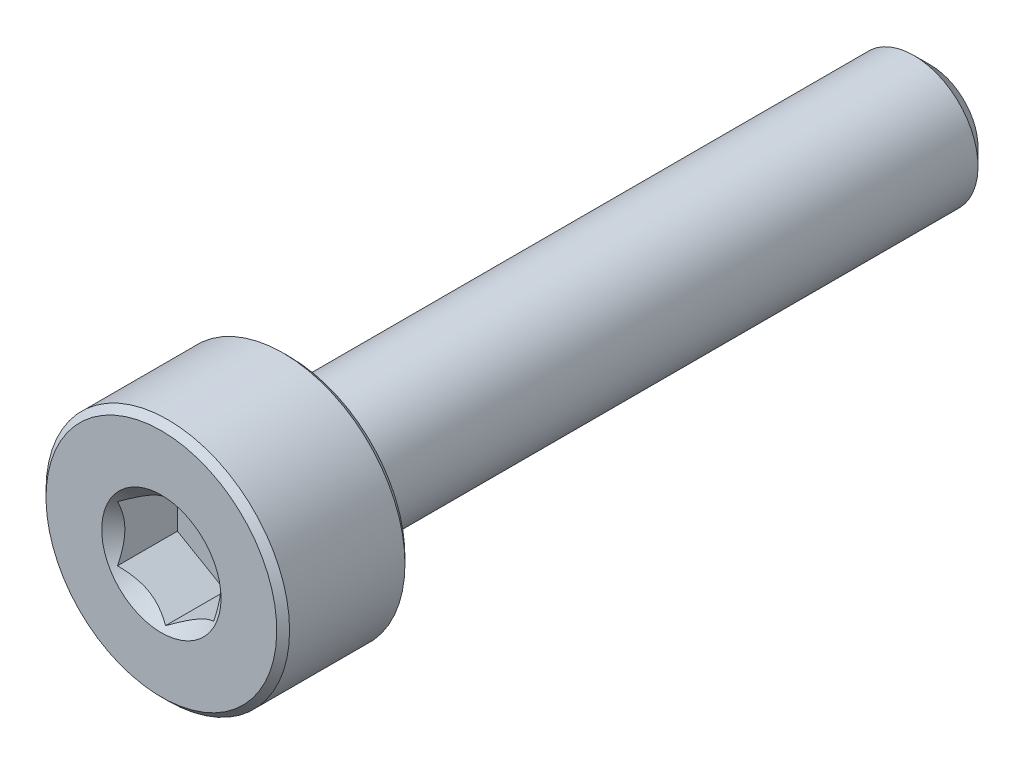
ISO-10303-21;
HEADER;
FILE_DESCRIPTION(('STEP AP214'),'2;1');
FILE_NAME('part.step','',(''),(''),'','','');
FILE_SCHEMA(('AUTOMOTIVE_DESIGN { 1 0 10303 214 1 1 1 1 }'));
ENDSEC;
DATA;
#1=APPLICATION_CONTEXT('core data for automotive mechanical design processes');
#2=APPLICATION_PROTOCOL_DEFINITION('international standard','automotive_design',2000,#1);
#3=PRODUCT_CONTEXT('',#1,'mechanical');
#4=PRODUCT('Part','Part','',(#3));
#5=PRODUCT_RELATED_PRODUCT_CATEGORY('part','',(#4));
#6=PRODUCT_DEFINITION_FORMATION('','',#4);
#7=PRODUCT_DEFINITION_CONTEXT('part definition',#1,'design');
#8=PRODUCT_DEFINITION('design','',#6,#7);
#9=PRODUCT_DEFINITION_SHAPE('','',#8);
#10=(LENGTH_UNIT() NAMED_UNIT(*) SI_UNIT(.MILLI.,.METRE.));
#11=(NAMED_UNIT(*) PLANE_ANGLE_UNIT() SI_UNIT($,.RADIAN.));
#12=(NAMED_UNIT(*) SI_UNIT($,.STERADIAN.) SOLID_ANGLE_UNIT());
#13=UNCERTAINTY_MEASURE_WITH_UNIT(LENGTH_MEASURE(1.E-05),#10,'distance_accuracy_value','');
#14=(GEOMETRIC_REPRESENTATION_CONTEXT(3) GLOBAL_UNCERTAINTY_ASSIGNED_CONTEXT((#13)) GLOBAL_UNIT_ASSIGNED_CONTEXT((#10,
#11,#12)) REPRESENTATION_CONTEXT('',''));
#15=CARTESIAN_POINT('',(0.,0.,0.));
#16=DIRECTION('',(0.,0.,1.));
#17=DIRECTION('',(1.,0.,0.));
#18=AXIS2_PLACEMENT_3D('',#15,#16,#17);
#19=CARTESIAN_POINT('',(0.,0.740192378864668,-6.));
#20=DIRECTION('',(0.,0.,-1.));
#21=DIRECTION('',(0.,1.,0.));
#22=AXIS2_PLACEMENT_3D('',#19,#20,#21);
#23=PLANE('',#22);
#24=CARTESIAN_POINT('',(0.,0.,-6.));
#25=DIRECTION('',(0.,0.,-1.));
#26=DIRECTION('',(0.,1.,0.));
#27=AXIS2_PLACEMENT_3D('',#24,#25,#26);
#28=CIRCLE('',#27,0.740192378864668);
#29=CARTESIAN_POINT('',(0.,0.740192378864668,-6.));
#30=VERTEX_POINT('',#29);
#31=EDGE_CURVE('E57',#30,#30,#28,.T.);
#32=ORIENTED_EDGE('',*,*,#31,.T.);
#33=EDGE_LOOP('',(#32));
#34=FACE_BOUND('',#33,.T.);
#35=ADVANCED_FACE('F43',(#34),#23,.T.);
#36=CARTESIAN_POINT('',(0.,0.,-6.));
#37=DIRECTION('',(0.,0.,1.));
#38=DIRECTION('',(0.,-1.,0.));
#39=AXIS2_PLACEMENT_3D('',#36,#37,#38);
#40=CONICAL_SURFACE('',#39,0.740192378864668,0.785398163397447);
#41=CARTESIAN_POINT('',(0.,0.,-5.74019237886467));
#42=DIRECTION('',(0.,0.,-1.));
#43=DIRECTION('',(0.,1.,0.));
#44=AXIS2_PLACEMENT_3D('',#41,#42,#43);
#45=CIRCLE('',#44,1.);
#46=CARTESIAN_POINT('',(0.,1.,-5.74019237886467));
#47=VERTEX_POINT('',#46);
#48=EDGE_CURVE('E175',#47,#47,#45,.T.);
#49=ORIENTED_EDGE('',*,*,#48,.T.);
#50=EDGE_LOOP('',(#49));
#51=FACE_BOUND('',#50,.T.);
#52=ORIENTED_EDGE('',*,*,#31,.F.);
#53=EDGE_LOOP('',(#52));
#54=FACE_BOUND('',#53,.T.);
#55=ADVANCED_FACE('F183',(#51,#54),#40,.T.);
#56=CARTESIAN_POINT('',(0.,0.,-6.));
#57=DIRECTION('',(0.,0.,-1.));
#58=DIRECTION('',(0.,1.,0.));
#59=AXIS2_PLACEMENT_3D('',#56,#57,#58);
#60=CYLINDRICAL_SURFACE('',#59,1.);
#61=CARTESIAN_POINT('',(0.,0.,3.9));
#62=DIRECTION('',(0.,0.,-1.));
#63=DIRECTION('',(0.,1.,0.));
#64=AXIS2_PLACEMENT_3D('',#61,#62,#63);
#65=CIRCLE('',#64,1.);
#66=CARTESIAN_POINT('',(0.,1.,3.9));
#67=VERTEX_POINT('',#66);
#68=EDGE_CURVE('E171',#67,#67,#65,.T.);
#69=ORIENTED_EDGE('',*,*,#68,.T.);
#70=EDGE_LOOP('',(#69));
#71=FACE_BOUND('',#70,.T.);
#72=ORIENTED_EDGE('',*,*,#48,.F.);
#73=EDGE_LOOP('',(#72));
#74=FACE_BOUND('',#73,.T.);
#75=ADVANCED_FACE('F185',(#71,#74),#60,.T.);
#76=CARTESIAN_POINT('',(0.,0.,3.9));
#77=DIRECTION('',(0.,0.,-1.));
#78=DIRECTION('',(0.,1.,0.));
#79=AXIS2_PLACEMENT_3D('',#76,#77,#78);
#80=TOROIDAL_SURFACE('',#79,1.1,0.0999999999999998);
#81=CARTESIAN_POINT('',(0.,0.,4.));
#82=DIRECTION('',(0.,0.,-1.));
#83=DIRECTION('',(0.,1.,0.));
#84=AXIS2_PLACEMENT_3D('',#81,#82,#83);
#85=CIRCLE('',#84,1.1);
#86=CARTESIAN_POINT('',(0.,1.1,4.));
#87=VERTEX_POINT('',#86);
#88=EDGE_CURVE('E167',#87,#87,#85,.T.);
#89=ORIENTED_EDGE('',*,*,#88,.T.);
#90=EDGE_LOOP('',(#89));
#91=FACE_BOUND('',#90,.T.);
#92=ORIENTED_EDGE('',*,*,#68,.F.);
#93=EDGE_LOOP('',(#92));
#94=FACE_BOUND('',#93,.T.);
#95=ADVANCED_FACE('F191',(#91,#94),#80,.F.);
#96=CARTESIAN_POINT('',(0.,1.8,4.));
#97=DIRECTION('',(0.,0.,-1.));
#98=DIRECTION('',(0.,1.,0.));
#99=AXIS2_PLACEMENT_3D('',#96,#97,#98);
#100=PLANE('',#99);
#101=CARTESIAN_POINT('',(0.,0.,4.));
#102=DIRECTION('',(0.,0.,-1.));
#103=DIRECTION('',(0.,1.,0.));
#104=AXIS2_PLACEMENT_3D('',#101,#102,#103);
#105=CIRCLE('',#104,1.8);
#106=CARTESIAN_POINT('',(0.,1.8,4.));
#107=VERTEX_POINT('',#106);
#108=EDGE_CURVE('E163',#107,#107,#105,.T.);
#109=ORIENTED_EDGE('',*,*,#108,.T.);
#110=EDGE_LOOP('',(#109));
#111=FACE_BOUND('',#110,.T.);
#112=ORIENTED_EDGE('',*,*,#88,.F.);
#113=EDGE_LOOP('',(#112));
#114=FACE_BOUND('',#113,.T.);
#115=ADVANCED_FACE('F197',(#111,#114),#100,.T.);
#116=CARTESIAN_POINT('',(0.,0.,4.));
#117=DIRECTION('',(0.,0.,1.));
#118=DIRECTION('',(0.,-1.,0.));
#119=AXIS2_PLACEMENT_3D('',#116,#117,#118);
#120=CONICAL_SURFACE('',#119,1.8,0.785398163397452);
#121=CARTESIAN_POINT('',(0.,0.,4.1));
#122=DIRECTION('',(0.,0.,-1.));
#123=DIRECTION('',(0.,1.,0.));
#124=AXIS2_PLACEMENT_3D('',#121,#122,#123);
#125=CIRCLE('',#124,1.9);
#126=CARTESIAN_POINT('',(0.,1.9,4.1));
#127=VERTEX_POINT('',#126);
#128=EDGE_CURVE('E159',#127,#127,#125,.T.);
#129=ORIENTED_EDGE('',*,*,#128,.T.);
#130=EDGE_LOOP('',(#129));
#131=FACE_BOUND('',#130,.T.);
#132=ORIENTED_EDGE('',*,*,#108,.F.);
#133=EDGE_LOOP('',(#132));
#134=FACE_BOUND('',#133,.T.);
#135=ADVANCED_FACE('F201',(#131,#134),#120,.T.);
#136=CARTESIAN_POINT('',(0.,0.,-6.));
#137=DIRECTION('',(0.,0.,-1.));
#138=DIRECTION('',(0.,1.,0.));
#139=AXIS2_PLACEMENT_3D('',#136,#137,#138);
#140=CYLINDRICAL_SURFACE('',#139,1.9);
#141=CARTESIAN_POINT('',(0.,0.,5.9));
#142=DIRECTION('',(0.,0.,-1.));
#143=DIRECTION('',(0.,1.,0.));
#144=AXIS2_PLACEMENT_3D('',#141,#142,#143);
#145=CIRCLE('',#144,1.9);
#146=CARTESIAN_POINT('',(0.,1.9,5.9));
#147=VERTEX_POINT('',#146);
#148=EDGE_CURVE('E155',#147,#147,#145,.T.);
#149=ORIENTED_EDGE('',*,*,#148,.T.);
#150=EDGE_LOOP('',(#149));
#151=FACE_BOUND('',#150,.T.);
#152=ORIENTED_EDGE('',*,*,#128,.F.);
#153=EDGE_LOOP('',(#152));
#154=FACE_BOUND('',#153,.T.);
#155=ADVANCED_FACE('F205',(#151,#154),#140,.T.);
#156=CARTESIAN_POINT('',(0.,0.,5.9));
#157=DIRECTION('',(0.,0.,-1.));
#158=DIRECTION('',(0.,1.,0.));
#159=AXIS2_PLACEMENT_3D('',#156,#157,#158);
#160=CONICAL_SURFACE('',#159,1.9,0.785398163397452);
#161=CARTESIAN_POINT('',(0.,0.,6.));
#162=DIRECTION('',(0.,0.,-1.));
#163=DIRECTION('',(0.,1.,0.));
#164=AXIS2_PLACEMENT_3D('',#161,#162,#163);
#165=CIRCLE('',#164,1.8);
#166=CARTESIAN_POINT('',(0.,1.8,6.));
#167=VERTEX_POINT('',#166);
#168=EDGE_CURVE('E151',#167,#167,#165,.T.);
#169=ORIENTED_EDGE('',*,*,#168,.T.);
#170=EDGE_LOOP('',(#169));
#171=FACE_BOUND('',#170,.T.);
#172=ORIENTED_EDGE('',*,*,#148,.F.);
#173=EDGE_LOOP('',(#172));
#174=FACE_BOUND('',#173,.T.);
#175=ADVANCED_FACE('F209',(#171,#174),#160,.T.);
#176=CARTESIAN_POINT('',(0.,0.,6.));
#177=DIRECTION('',(0.,0.,1.));
#178=DIRECTION('',(0.,-1.,0.));
#179=AXIS2_PLACEMENT_3D('',#176,#177,#178);
#180=PLANE('',#179);
#181=CARTESIAN_POINT('',(0.,0.,6.));
#182=DIRECTION('',(0.,0.,1.));
#183=DIRECTION('',(1.,0.,0.));
#184=AXIS2_PLACEMENT_3D('',#181,#182,#183);
#185=CIRCLE('',#184,0.930977309068267);
#186=CARTESIAN_POINT('',(0.930977309068267,0.,6.));
#187=VERTEX_POINT('',#186);
#188=EDGE_CURVE('E117',#187,#187,#185,.T.);
#189=ORIENTED_EDGE('',*,*,#188,.F.);
#190=EDGE_LOOP('',(#189));
#191=FACE_BOUND('',#190,.T.);
#192=ORIENTED_EDGE('',*,*,#168,.F.);
#193=EDGE_LOOP('',(#192));
#194=FACE_BOUND('',#193,.T.);
#195=ADVANCED_FACE('F213',(#191,#194),#180,.T.);
#196=CARTESIAN_POINT('',(0.,0.,6.));
#197=DIRECTION('',(0.,0.,1.));
#198=DIRECTION('',(1.,0.,0.));
#199=AXIS2_PLACEMENT_3D('',#196,#197,#198);
#200=CONICAL_SURFACE('',#199,0.930977309068267,0.78539816339745);
#201=ORIENTED_EDGE('',*,*,#188,.T.);
#202=EDGE_LOOP('',(#201));
#203=FACE_BOUND('',#202,.T.);
#204=CARTESIAN_POINT('',(-0.000200000000000882,-0.86614087383827,5.93516358786094));
#205=CARTESIAN_POINT('',(0.0255899625576805,-0.851251032013203,5.92028220518009));
#206=CARTESIAN_POINT('',(0.0518112021286581,-0.836112192288413,5.90627436032312));
#207=CARTESIAN_POINT('',(0.105279708235705,-0.805242135894342,5.88062561939842));
#208=CARTESIAN_POINT('',(0.132532067460571,-0.789507978959813,5.86899900642183));
#209=CARTESIAN_POINT('',(0.187485350381351,-0.757780686272647,5.84908214048841));
#210=CARTESIAN_POINT('',(0.215172256695507,-0.741795643459142,5.84074178879754));
#211=CARTESIAN_POINT('',(0.271155595130851,-0.709473647943362,5.82789083667759));
#212=CARTESIAN_POINT('',(0.299450314843642,-0.693137683900537,5.823370635305));
#213=CARTESIAN_POINT('',(0.348210289268841,-0.664986099540469,5.8192939278136));
#214=CARTESIAN_POINT('',(0.36861206565557,-0.653207128451645,5.81869089133025));
#215=CARTESIAN_POINT('',(0.409376134696357,-0.629671982217682,5.81970260073169));
#216=CARTESIAN_POINT('',(0.429738417651452,-0.617915812672242,5.8213178357062));
#217=CARTESIAN_POINT('',(0.49053454308682,-0.582815153286446,5.82938424168921));
#218=CARTESIAN_POINT('',(0.530665854996095,-0.559645329552694,5.83905703054389));
#219=CARTESIAN_POINT('',(0.601110400354022,-0.518974152327354,5.86240441268848));
#220=CARTESIAN_POINT('',(0.631753572009084,-0.50128230892348,5.87485665278842));
#221=CARTESIAN_POINT('',(0.691839345804789,-0.466591771248063,5.90290770494703));
#222=CARTESIAN_POINT('',(0.72128548838159,-0.44959103290475,5.91849628061992));
#223=CARTESIAN_POINT('',(0.7502,-0.432897231838375,5.93516358786094));
#224=B_SPLINE_CURVE_WITH_KNOTS('',3,(#204,#205,#206,#207,#208,#209,#210,#211,#212,#213,#214,
#215,#216,#217,#218,#219,#220,#221,#222,#223),.UNSPECIFIED.,.F.,.F.,(4,2,2,2,2,2,2,2,2,4),(0.,
0.0999419466095593,0.200466857654445,0.299393763705715,0.398071297300228,0.468665775681745,
0.539275821398836,0.680536257244562,0.792918418368073,0.904939568716033),.UNSPECIFIED.);
#225=CARTESIAN_POINT('',(0.,-0.866025403784432,5.93504809471617));
#226=VERTEX_POINT('',#225);
#227=CARTESIAN_POINT('',(0.75,-0.433012701892213,5.93504809471617));
#228=VERTEX_POINT('',#227);
#229=EDGE_CURVE('E12',#226,#228,#224,.T.);
#230=ORIENTED_EDGE('',*,*,#229,.F.);
#231=CARTESIAN_POINT('',(-0.750199999999995,-0.43289723183838,5.93516358786094));
#232=CARTESIAN_POINT('',(-0.724410037442314,-0.447787073663448,5.92028220518009));
#233=CARTESIAN_POINT('',(-0.698188797871336,-0.462925913388237,5.90627436032312));
#234=CARTESIAN_POINT('',(-0.644720291764289,-0.493795969782308,5.88062561939843));
#235=CARTESIAN_POINT('',(-0.617467932539423,-0.509530126716837,5.86899900642183));
#236=CARTESIAN_POINT('',(-0.562514649618643,-0.541257419404003,5.84908214048841));
#237=CARTESIAN_POINT('',(-0.534827743304487,-0.557242462217509,5.84074178879754));
#238=CARTESIAN_POINT('',(-0.478844404869143,-0.589564457733288,5.82789083667759));
#239=CARTESIAN_POINT('',(-0.450549685156351,-0.605900421776113,5.82337063530501));
#240=CARTESIAN_POINT('',(-0.401789710731153,-0.634052006136181,5.8192939278136));
#241=CARTESIAN_POINT('',(-0.381387934344424,-0.645830977225005,5.81869089133025));
#242=CARTESIAN_POINT('',(-0.340623865303636,-0.669366123458968,5.81970260073169));
#243=CARTESIAN_POINT('',(-0.320261582348541,-0.681122293004408,5.8213178357062));
#244=CARTESIAN_POINT('',(-0.259465456913173,-0.716222952390204,5.82938424168921));
#245=CARTESIAN_POINT('',(-0.219334145003898,-0.739392776123957,5.83905703054389));
#246=CARTESIAN_POINT('',(-0.148889599645972,-0.780063953349296,5.86240441268848));
#247=CARTESIAN_POINT('',(-0.118246427990912,-0.797755796753168,5.87485665278842));
#248=CARTESIAN_POINT('',(-0.0581606541952101,-0.832446334428584,5.90290770494703));
#249=CARTESIAN_POINT('',(-0.0287145116184097,-0.849447072771895,5.91849628061992));
#250=CARTESIAN_POINT('',(0.000199999999998813,-0.86614087383827,5.93516358786094));
#251=B_SPLINE_CURVE_WITH_KNOTS('',3,(#231,#232,#233,#234,#235,#236,#237,#238,#239,#240,#241,
#242,#243,#244,#245,#246,#247,#248,#249,#250),.UNSPECIFIED.,.F.,.F.,(4,2,2,2,2,2,2,2,2,4),(0.,
0.0999419466095594,0.200466857654445,0.299393763705716,0.398071297300229,0.468665775681746,
0.539275821398837,0.680536257244564,0.792918418368068,0.904939568716024),.UNSPECIFIED.);
#252=CARTESIAN_POINT('',(-0.749999999999995,-0.433012701892218,5.93504809471617));
#253=VERTEX_POINT('',#252);
#254=EDGE_CURVE('E102',#253,#226,#251,.T.);
#255=ORIENTED_EDGE('',*,*,#254,.F.);
#256=CARTESIAN_POINT('',(-0.749999999999995,-0.908993158424501,6.24748294145465));
#257=CARTESIAN_POINT('',(-0.749999999999995,-0.887052399965032,6.23056165232909));
#258=CARTESIAN_POINT('',(-0.749999999999995,-0.864994452544439,6.21379277142181));
#259=CARTESIAN_POINT('',(-0.749999999999995,-0.820595091161565,6.18062405791495));
#260=CARTESIAN_POINT('',(-0.749999999999995,-0.798253612413865,6.16422431212463));
#261=CARTESIAN_POINT('',(-0.749999999999995,-0.730403515944951,6.11544094980941));
#262=CARTESIAN_POINT('',(-0.749999999999995,-0.684401486090211,6.08373263056153));
#263=CARTESIAN_POINT('',(-0.749999999999995,-0.587630943752086,6.02105127073776));
#264=CARTESIAN_POINT('',(-0.749999999999995,-0.536746006676904,5.99025604006539));
#265=CARTESIAN_POINT('',(-0.749999999999995,-0.432383376454021,5.93362577183307));
#266=CARTESIAN_POINT('',(-0.749999999999995,-0.378915238071278,5.90777398153742));
#267=CARTESIAN_POINT('',(-0.749999999999996,-0.299071429351745,5.876137143555));
#268=CARTESIAN_POINT('',(-0.749999999999996,-0.273980510808172,5.86713858920674));
#269=CARTESIAN_POINT('',(-0.749999999999996,-0.223167896807674,5.85114618527223));
#270=CARTESIAN_POINT('',(-0.749999999999996,-0.197446161667869,5.8441524621572));
#271=CARTESIAN_POINT('',(-0.749999999999996,-0.120459338268895,5.82702750339353));
#272=CARTESIAN_POINT('',(-0.749999999999996,-0.0683464355179093,5.82031613453524));
#273=CARTESIAN_POINT('',(-0.749999999999996,0.0337920589257216,5.81812532119166));
#274=CARTESIAN_POINT('',(-0.749999999999996,0.0838066628456615,5.82215654120047));
#275=CARTESIAN_POINT('',(-0.749999999999996,0.157981834018415,5.83507488581104));
#276=CARTESIAN_POINT('',(-0.749999999999996,0.182796003556084,5.84061230050464));
#277=CARTESIAN_POINT('',(-0.749999999999996,0.23188716656574,5.853698524901));
#278=CARTESIAN_POINT('',(-0.749999999999996,0.256164188491815,5.86124722778305));
#279=CARTESIAN_POINT('',(-0.749999999999996,0.330659225549256,5.88730560295686));
#280=CARTESIAN_POINT('',(-0.749999999999996,0.379861121085843,5.90870212699338));
#281=CARTESIAN_POINT('',(-0.749999999999996,0.475970605705222,5.95631977440889));
#282=CARTESIAN_POINT('',(-0.749999999999996,0.522869373813369,5.98255785460995));
#283=CARTESIAN_POINT('',(-0.749999999999996,0.612520945812658,6.03673908179183));
#284=CARTESIAN_POINT('',(-0.749999999999996,0.655364174071619,6.06453453547661));
#285=CARTESIAN_POINT('',(-0.749999999999997,0.718484766813282,6.10752522590747));
#286=CARTESIAN_POINT('',(-0.749999999999997,0.739253587078312,6.12201132387884));
#287=CARTESIAN_POINT('',(-0.749999999999997,0.78050622968975,6.15137241519742));
#288=CARTESIAN_POINT('',(-0.749999999999997,0.800990128619761,6.16624730082227));
#289=CARTESIAN_POINT('',(-0.749999999999997,0.821355148585425,6.18128357764302));
#290=B_SPLINE_CURVE_WITH_KNOTS('',3,(#256,#257,#258,#259,#260,#261,#262,#263,#264,#265,#266,
#267,#268,#269,#270,#271,#272,#273,#274,#275,#276,#277,#278,#279,#280,#281,#282,#283,#284,#285,
#286,#287,#288,#289),.UNSPECIFIED.,.F.,.F.,(4,2,2,2,2,2,2,2,2,2,2,2,2,2,2,2,4),(0.,
0.0831217081502307,0.166262763947899,0.333808791437732,0.512108301465775,0.689792429955631,
0.769685928013999,0.849584464902762,1.00608040173681,1.15557098404965,1.23177009418091,
1.30796515813853,1.46846030983728,1.62952862501053,1.78266144768383,1.85862369010575,
1.93456510404422),.UNSPECIFIED.);
#291=CARTESIAN_POINT('',(-0.749999999999996,0.433012701892217,5.93504809471617));
#292=VERTEX_POINT('',#291);
#293=EDGE_CURVE('E116',#292,#253,#290,.F.);
#294=ORIENTED_EDGE('',*,*,#293,.F.);
#295=CARTESIAN_POINT('',(0.000199999999999783,0.866140873838272,5.93516358786094));
#296=CARTESIAN_POINT('',(-0.0255899625576815,0.851251032013204,5.92028220518009));
#297=CARTESIAN_POINT('',(-0.0518112021286592,0.836112192288415,5.90627436032312));
#298=CARTESIAN_POINT('',(-0.105279708235706,0.805242135894344,5.88062561939843));
#299=CARTESIAN_POINT('',(-0.132532067460572,0.789507978959815,5.86899900642184));
#300=CARTESIAN_POINT('',(-0.187485350381352,0.757780686272649,5.84908214048841));
#301=CARTESIAN_POINT('',(-0.215172256695509,0.741795643459143,5.84074178879754));
#302=CARTESIAN_POINT('',(-0.271155595130852,0.709473647943364,5.82789083667759));
#303=CARTESIAN_POINT('',(-0.299450314843644,0.693137683900538,5.82337063530501));
#304=CARTESIAN_POINT('',(-0.348210289268842,0.664986099540471,5.8192939278136));
#305=CARTESIAN_POINT('',(-0.368612065655571,0.653207128451646,5.81869089133025));
#306=CARTESIAN_POINT('',(-0.409376134696358,0.629671982217683,5.81970260073169));
#307=CARTESIAN_POINT('',(-0.429738417651453,0.617915812672244,5.8213178357062));
#308=CARTESIAN_POINT('',(-0.490534543086821,0.582815153286448,5.82938424168921));
#309=CARTESIAN_POINT('',(-0.530665854996097,0.559645329552695,5.83905703054389));
#310=CARTESIAN_POINT('',(-0.601110400354023,0.518974152327355,5.86240441268848));
#311=CARTESIAN_POINT('',(-0.631753572009083,0.501282308923482,5.87485665278842));
#312=CARTESIAN_POINT('',(-0.691839345804786,0.466591771248066,5.90290770494703));
#313=CARTESIAN_POINT('',(-0.721285488381587,0.449591032904754,5.91849628061992));
#314=CARTESIAN_POINT('',(-0.750199999999996,0.432897231838379,5.93516358786094));
#315=B_SPLINE_CURVE_WITH_KNOTS('',3,(#295,#296,#297,#298,#299,#300,#301,#302,#303,#304,#305,
#306,#307,#308,#309,#310,#311,#312,#313,#314),.UNSPECIFIED.,.F.,.F.,(4,2,2,2,2,2,2,2,2,4),(0.,
0.0999419466095594,0.200466857654445,0.299393763705716,0.398071297300228,0.468665775681745,
0.539275821398836,0.680536257244563,0.79291841836807,0.904939568716027),.UNSPECIFIED.);
#316=CARTESIAN_POINT('',(0.,0.866025403784434,5.93504809471617));
#317=VERTEX_POINT('',#316);
#318=EDGE_CURVE('E264',#317,#292,#315,.T.);
#319=ORIENTED_EDGE('',*,*,#318,.F.);
#320=CARTESIAN_POINT('',(0.7502,0.432897231838378,5.93516358786094));
#321=CARTESIAN_POINT('',(0.724410037442318,0.447787073663446,5.92028220518009));
#322=CARTESIAN_POINT('',(0.69818879787134,0.462925913388236,5.90627436032313));
#323=CARTESIAN_POINT('',(0.644720291764293,0.493795969782307,5.88062561939843));
#324=CARTESIAN_POINT('',(0.617467932539426,0.509530126716836,5.86899900642184));
#325=CARTESIAN_POINT('',(0.562514649618646,0.541257419404002,5.84908214048841));
#326=CARTESIAN_POINT('',(0.534827743304489,0.557242462217508,5.84074178879754));
#327=CARTESIAN_POINT('',(0.478844404869145,0.589564457733288,5.8278908366776));
#328=CARTESIAN_POINT('',(0.450549685156352,0.605900421776114,5.82337063530501));
#329=CARTESIAN_POINT('',(0.401789710731154,0.634052006136181,5.81929392781361));
#330=CARTESIAN_POINT('',(0.381387934344425,0.645830977225006,5.81869089133025));
#331=CARTESIAN_POINT('',(0.340623865303637,0.669366123458969,5.8197026007317));
#332=CARTESIAN_POINT('',(0.320261582348542,0.681122293004408,5.8213178357062));
#333=CARTESIAN_POINT('',(0.259465456913174,0.716222952390205,5.82938424168921));
#334=CARTESIAN_POINT('',(0.219334145003898,0.739392776123957,5.83905703054389));
#335=CARTESIAN_POINT('',(0.148889599645972,0.780063953349297,5.86240441268848));
#336=CARTESIAN_POINT('',(0.118246427990912,0.797755796753169,5.87485665278842));
#337=CARTESIAN_POINT('',(0.0581606541952097,0.832446334428585,5.90290770494703));
#338=CARTESIAN_POINT('',(0.028714511618409,0.849447072771897,5.91849628061992));
#339=CARTESIAN_POINT('',(-0.000200000000000035,0.866140873838272,5.93516358786094));
#340=B_SPLINE_CURVE_WITH_KNOTS('',3,(#320,#321,#322,#323,#324,#325,#326,#327,#328,#329,#330,
#331,#332,#333,#334,#335,#336,#337,#338,#339),.UNSPECIFIED.,.F.,.F.,(4,2,2,2,2,2,2,2,2,4),(0.,
0.0999419466095599,0.200466857654447,0.299393763705719,0.398071297300233,0.468665775681751,
0.539275821398842,0.680536257244569,0.792918418368074,0.904939568716031),.UNSPECIFIED.);
#341=CARTESIAN_POINT('',(0.75,0.433012701892216,5.93504809471617));
#342=VERTEX_POINT('',#341);
#343=EDGE_CURVE('E237',#342,#317,#340,.T.);
#344=ORIENTED_EDGE('',*,*,#343,.F.);
#345=CARTESIAN_POINT('',(0.75,-0.90899315842449,6.24748294145465));
#346=CARTESIAN_POINT('',(0.75,-0.887052399965022,6.23056165232909));
#347=CARTESIAN_POINT('',(0.75,-0.864994452544429,6.21379277142181));
#348=CARTESIAN_POINT('',(0.75,-0.820595091161555,6.18062405791495));
#349=CARTESIAN_POINT('',(0.75,-0.798253612413856,6.16422431212463));
#350=CARTESIAN_POINT('',(0.75,-0.730403515944942,6.1154409498094));
#351=CARTESIAN_POINT('',(0.75,-0.684401486090202,6.08373263056153));
#352=CARTESIAN_POINT('',(0.75,-0.587630943752078,6.02105127073776));
#353=CARTESIAN_POINT('',(0.75,-0.536746006676896,5.99025604006539));
#354=CARTESIAN_POINT('',(0.75,-0.432383376454015,5.93362577183307));
#355=CARTESIAN_POINT('',(0.75,-0.378915238071272,5.90777398153742));
#356=CARTESIAN_POINT('',(0.75,-0.299071429351739,5.876137143555));
#357=CARTESIAN_POINT('',(0.75,-0.273980510808166,5.86713858920674));
#358=CARTESIAN_POINT('',(0.75,-0.223167896807669,5.85114618527224));
#359=CARTESIAN_POINT('',(0.75,-0.197446161667865,5.84415246215721));
#360=CARTESIAN_POINT('',(0.75,-0.120459338268891,5.82702750339354));
#361=CARTESIAN_POINT('',(0.75,-0.0683464355179052,5.82031613453524));
#362=CARTESIAN_POINT('',(0.75,0.0337920589257253,5.81812532119166));
#363=CARTESIAN_POINT('',(0.75,0.0838066628456652,5.82215654120047));
#364=CARTESIAN_POINT('',(0.75,0.157981834018418,5.83507488581104));
#365=CARTESIAN_POINT('',(0.75,0.182796003556087,5.84061230050464));
#366=CARTESIAN_POINT('',(0.75,0.231887166565743,5.85369852490101));
#367=CARTESIAN_POINT('',(0.75,0.256164188491818,5.86124722778306));
#368=CARTESIAN_POINT('',(0.75,0.330659225549259,5.88730560295687));
#369=CARTESIAN_POINT('',(0.75,0.379861121085847,5.90870212699338));
#370=CARTESIAN_POINT('',(0.75,0.475970605705227,5.95631977440889));
#371=CARTESIAN_POINT('',(0.75,0.522869373813374,5.98255785460996));
#372=CARTESIAN_POINT('',(0.75,0.612520945812664,6.03673908179184));
#373=CARTESIAN_POINT('',(0.75,0.655364174071626,6.06453453547662));
#374=CARTESIAN_POINT('',(0.75,0.718484766813289,6.10752522590748));
#375=CARTESIAN_POINT('',(0.75,0.739253587078319,6.12201132387884));
#376=CARTESIAN_POINT('',(0.75,0.780506229689757,6.15137241519742));
#377=CARTESIAN_POINT('',(0.75,0.800990128619769,6.16624730082228));
#378=CARTESIAN_POINT('',(0.75,0.821355148585432,6.18128357764303));
#379=B_SPLINE_CURVE_WITH_KNOTS('',3,(#345,#346,#347,#348,#349,#350,#351,#352,#353,#354,#355,
#356,#357,#358,#359,#360,#361,#362,#363,#364,#365,#366,#367,#368,#369,#370,#371,#372,#373,#374,
#375,#376,#377,#378),.UNSPECIFIED.,.F.,.F.,(4,2,2,2,2,2,2,2,2,2,2,2,2,2,2,2,4),(0.,
0.0831217081502297,0.166262763947897,0.333808791437728,0.512108301465769,0.689792429955623,
0.76968592801399,0.849584464902752,1.0060804017368,1.15557098404964,1.2317700941809,
1.30796515813852,1.46846030983727,1.62952862501053,1.78266144768382,1.85862369010574,
1.93456510404421),.UNSPECIFIED.);
#380=EDGE_CURVE('E64',#228,#342,#379,.T.);
#381=ORIENTED_EDGE('',*,*,#380,.F.);
#382=EDGE_LOOP('',(#230,#255,#294,#319,#344,#381));
#383=FACE_BOUND('',#382,.T.);
#384=ADVANCED_FACE('F101',(#203,#383),#200,.F.);
#385=CARTESIAN_POINT('',(0.,1.8,5.));
#386=DIRECTION('',(0.,0.,-1.));
#387=DIRECTION('',(0.,1.,0.));
#388=AXIS2_PLACEMENT_3D('',#385,#386,#387);
#389=PLANE('',#388);
#390=DIRECTION('',(0.866025403784439,0.5,0.));
#391=VECTOR('',#390,1.);
#392=CARTESIAN_POINT('',(0.,-0.866025403784432,5.));
#393=LINE('',#392,#391);
#394=CARTESIAN_POINT('',(0.,-0.866025403784432,5.));
#395=VERTEX_POINT('',#394);
#396=CARTESIAN_POINT('',(0.75,-0.433012701892213,5.));
#397=VERTEX_POINT('',#396);
#398=EDGE_CURVE('E120',#395,#397,#393,.T.);
#399=ORIENTED_EDGE('',*,*,#398,.T.);
#400=DIRECTION('',(0.,1.,0.));
#401=VECTOR('',#400,1.);
#402=CARTESIAN_POINT('',(0.75,-0.433012701892213,5.));
#403=LINE('',#402,#401);
#404=CARTESIAN_POINT('',(0.75,0.433012701892216,5.));
#405=VERTEX_POINT('',#404);
#406=EDGE_CURVE('E71',#397,#405,#403,.T.);
#407=ORIENTED_EDGE('',*,*,#406,.T.);
#408=DIRECTION('',(-0.866025403784439,0.499999999999999,0.));
#409=VECTOR('',#408,1.);
#410=CARTESIAN_POINT('',(0.75,0.433012701892216,5.));
#411=LINE('',#410,#409);
#412=CARTESIAN_POINT('',(0.,0.866025403784434,5.));
#413=VERTEX_POINT('',#412);
#414=EDGE_CURVE('E131',#405,#413,#411,.T.);
#415=ORIENTED_EDGE('',*,*,#414,.T.);
#416=DIRECTION('',(-0.866025403784438,-0.5,0.));
#417=VECTOR('',#416,1.);
#418=CARTESIAN_POINT('',(0.,0.866025403784434,5.));
#419=LINE('',#418,#417);
#420=CARTESIAN_POINT('',(-0.749999999999996,0.433012701892217,5.));
#421=VERTEX_POINT('',#420);
#422=EDGE_CURVE('E140',#413,#421,#419,.T.);
#423=ORIENTED_EDGE('',*,*,#422,.T.);
#424=DIRECTION('',(0.,-1.,0.));
#425=VECTOR('',#424,1.);
#426=CARTESIAN_POINT('',(-0.749999999999996,0.433012701892217,5.));
#427=LINE('',#426,#425);
#428=CARTESIAN_POINT('',(-0.749999999999995,-0.433012701892218,5.));
#429=VERTEX_POINT('',#428);
#430=EDGE_CURVE('E135',#421,#429,#427,.T.);
#431=ORIENTED_EDGE('',*,*,#430,.T.);
#432=DIRECTION('',(0.866025403784439,-0.499999999999999,0.));
#433=VECTOR('',#432,1.);
#434=CARTESIAN_POINT('',(-0.749999999999995,-0.433012701892218,5.));
#435=LINE('',#434,#433);
#436=EDGE_CURVE('E122',#429,#395,#435,.T.);
#437=ORIENTED_EDGE('',*,*,#436,.T.);
#438=EDGE_LOOP('',(#399,#407,#415,#423,#431,#437));
#439=FACE_BOUND('',#438,.T.);
#440=ADVANCED_FACE('F218',(#439),#389,.F.);
#441=CARTESIAN_POINT('',(0.,-0.866025403784432,1.70871215252209));
#442=DIRECTION('',(0.5,-0.866025403784439,0.));
#443=DIRECTION('',(0.866025403784439,0.5,0.));
#444=AXIS2_PLACEMENT_3D('',#441,#442,#443);
#445=PLANE('',#444);
#446=DIRECTION('',(0.,0.,1.));
#447=VECTOR('',#446,1.);
#448=CARTESIAN_POINT('',(0.,-0.866025403784432,1.70871215252209));
#449=LINE('',#448,#447);
#450=EDGE_CURVE('E111',#395,#226,#449,.T.);
#451=ORIENTED_EDGE('',*,*,#450,.T.);
#452=ORIENTED_EDGE('',*,*,#229,.T.);
#453=DIRECTION('',(0.,0.,1.));
#454=VECTOR('',#453,1.);
#455=CARTESIAN_POINT('',(0.75,-0.433012701892213,1.70871215252209));
#456=LINE('',#455,#454);
#457=EDGE_CURVE('E126',#397,#228,#456,.T.);
#458=ORIENTED_EDGE('',*,*,#457,.F.);
#459=ORIENTED_EDGE('',*,*,#398,.F.);
#460=EDGE_LOOP('',(#451,#452,#458,#459));
#461=FACE_BOUND('',#460,.T.);
#462=ADVANCED_FACE('F119',(#461),#445,.F.);
#463=CARTESIAN_POINT('',(-0.749999999999995,-0.433012701892218,1.70871215252209));
#464=DIRECTION('',(-0.499999999999999,-0.866025403784439,0.));
#465=DIRECTION('',(0.866025403784439,-0.499999999999999,0.));
#466=AXIS2_PLACEMENT_3D('',#463,#464,#465);
#467=PLANE('',#466);
#468=DIRECTION('',(0.,0.,1.));
#469=VECTOR('',#468,1.);
#470=CARTESIAN_POINT('',(-0.749999999999995,-0.433012701892218,1.70871215252209));
#471=LINE('',#470,#469);
#472=EDGE_CURVE('E114',#429,#253,#471,.T.);
#473=ORIENTED_EDGE('',*,*,#472,.T.);
#474=ORIENTED_EDGE('',*,*,#254,.T.);
#475=ORIENTED_EDGE('',*,*,#450,.F.);
#476=ORIENTED_EDGE('',*,*,#436,.F.);
#477=EDGE_LOOP('',(#473,#474,#475,#476));
#478=FACE_BOUND('',#477,.T.);
#479=ADVANCED_FACE('F110',(#478),#467,.F.);
#480=CARTESIAN_POINT('',(-0.749999999999996,0.433012701892217,1.70871215252209));
#481=DIRECTION('',(-1.,0.,0.));
#482=DIRECTION('',(0.,-1.,0.));
#483=AXIS2_PLACEMENT_3D('',#480,#481,#482);
#484=PLANE('',#483);
#485=DIRECTION('',(0.,0.,1.));
#486=VECTOR('',#485,1.);
#487=CARTESIAN_POINT('',(-0.749999999999996,0.433012701892217,1.70871215252209));
#488=LINE('',#487,#486);
#489=EDGE_CURVE('E136',#421,#292,#488,.T.);
#490=ORIENTED_EDGE('',*,*,#489,.T.);
#491=ORIENTED_EDGE('',*,*,#293,.T.);
#492=ORIENTED_EDGE('',*,*,#472,.F.);
#493=ORIENTED_EDGE('',*,*,#430,.F.);
#494=EDGE_LOOP('',(#490,#491,#492,#493));
#495=FACE_BOUND('',#494,.T.);
#496=ADVANCED_FACE('F274',(#495),#484,.F.);
#497=CARTESIAN_POINT('',(0.,0.866025403784434,1.70871215252209));
#498=DIRECTION('',(-0.5,0.866025403784438,0.));
#499=DIRECTION('',(-0.866025403784438,-0.5,0.));
#500=AXIS2_PLACEMENT_3D('',#497,#498,#499);
#501=PLANE('',#500);
#502=DIRECTION('',(0.,0.,1.));
#503=VECTOR('',#502,1.);
#504=CARTESIAN_POINT('',(0.,0.866025403784434,1.70871215252209));
#505=LINE('',#504,#503);
#506=EDGE_CURVE('E141',#413,#317,#505,.T.);
#507=ORIENTED_EDGE('',*,*,#506,.T.);
#508=ORIENTED_EDGE('',*,*,#318,.T.);
#509=ORIENTED_EDGE('',*,*,#489,.F.);
#510=ORIENTED_EDGE('',*,*,#422,.F.);
#511=EDGE_LOOP('',(#507,#508,#509,#510));
#512=FACE_BOUND('',#511,.T.);
#513=ADVANCED_FACE('F271',(#512),#501,.F.);
#514=CARTESIAN_POINT('',(0.75,0.433012701892216,1.70871215252209));
#515=DIRECTION('',(0.499999999999999,0.866025403784439,0.));
#516=DIRECTION('',(-0.866025403784439,0.499999999999999,0.));
#517=AXIS2_PLACEMENT_3D('',#514,#515,#516);
#518=PLANE('',#517);
#519=DIRECTION('',(0.,0.,1.));
#520=VECTOR('',#519,1.);
#521=CARTESIAN_POINT('',(0.75,0.433012701892216,1.70871215252209));
#522=LINE('',#521,#520);
#523=EDGE_CURVE('E145',#405,#342,#522,.T.);
#524=ORIENTED_EDGE('',*,*,#523,.T.);
#525=ORIENTED_EDGE('',*,*,#343,.T.);
#526=ORIENTED_EDGE('',*,*,#506,.F.);
#527=ORIENTED_EDGE('',*,*,#414,.F.);
#528=EDGE_LOOP('',(#524,#525,#526,#527));
#529=FACE_BOUND('',#528,.T.);
#530=ADVANCED_FACE('F226',(#529),#518,.F.);
#531=CARTESIAN_POINT('',(0.75,-0.433012701892213,1.70871215252209));
#532=DIRECTION('',(1.,0.,0.));
#533=DIRECTION('',(0.,0.,-1.));
#534=AXIS2_PLACEMENT_3D('',#531,#532,#533);
#535=PLANE('',#534);
#536=ORIENTED_EDGE('',*,*,#457,.T.);
#537=ORIENTED_EDGE('',*,*,#380,.T.);
#538=ORIENTED_EDGE('',*,*,#523,.F.);
#539=ORIENTED_EDGE('',*,*,#406,.F.);
#540=EDGE_LOOP('',(#536,#537,#538,#539));
#541=FACE_BOUND('',#540,.T.);
#542=ADVANCED_FACE('F222',(#541),#535,.F.);
#543=CLOSED_SHELL('',(#35,#55,#75,#95,#115,#135,#155,#175,#195,#384,#440,#462,#479,#496,#513,
#530,#542));
#544=MANIFOLD_SOLID_BREP('B2',#543);
#545=ADVANCED_BREP_SHAPE_REPRESENTATION('',(#18,#544),#14);
#546=SHAPE_DEFINITION_REPRESENTATION(#9,#545);
ENDSEC;
END-ISO-10303-21;
